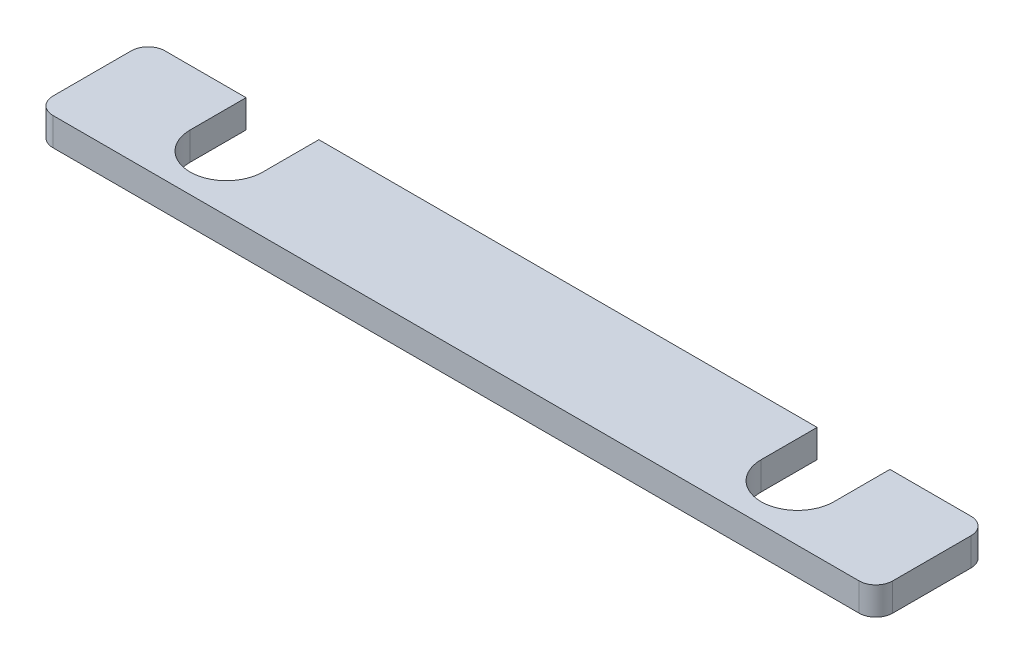
ISO-10303-21;
HEADER;
FILE_DESCRIPTION(('STEP AP214'),'2;1');
FILE_NAME('part.step','',(''),(''),'','','');
FILE_SCHEMA(('AUTOMOTIVE_DESIGN { 1 0 10303 214 1 1 1 1 }'));
ENDSEC;
DATA;
#1=APPLICATION_CONTEXT('core data for automotive mechanical design processes');
#2=APPLICATION_PROTOCOL_DEFINITION('international standard','automotive_design',2000,#1);
#3=PRODUCT_CONTEXT('',#1,'mechanical');
#4=PRODUCT('Part','Part','',(#3));
#5=PRODUCT_RELATED_PRODUCT_CATEGORY('part','',(#4));
#6=PRODUCT_DEFINITION_FORMATION('','',#4);
#7=PRODUCT_DEFINITION_CONTEXT('part definition',#1,'design');
#8=PRODUCT_DEFINITION('design','',#6,#7);
#9=PRODUCT_DEFINITION_SHAPE('','',#8);
#10=(LENGTH_UNIT() NAMED_UNIT(*) SI_UNIT(.MILLI.,.METRE.));
#11=(NAMED_UNIT(*) PLANE_ANGLE_UNIT() SI_UNIT($,.RADIAN.));
#12=(NAMED_UNIT(*) SI_UNIT($,.STERADIAN.) SOLID_ANGLE_UNIT());
#13=UNCERTAINTY_MEASURE_WITH_UNIT(LENGTH_MEASURE(1.E-05),#10,'distance_accuracy_value','');
#14=(GEOMETRIC_REPRESENTATION_CONTEXT(3) GLOBAL_UNCERTAINTY_ASSIGNED_CONTEXT((#13)) GLOBAL_UNIT_ASSIGNED_CONTEXT((#10,
#11,#12)) REPRESENTATION_CONTEXT('',''));
#15=CARTESIAN_POINT('',(0.,0.,0.));
#16=DIRECTION('',(0.,0.,1.));
#17=DIRECTION('',(1.,0.,0.));
#18=AXIS2_PLACEMENT_3D('',#15,#16,#17);
#19=CARTESIAN_POINT('',(-75.,-5.,-10.));
#20=DIRECTION('',(0.,0.,-1.));
#21=DIRECTION('',(-1.,0.,0.));
#22=AXIS2_PLACEMENT_3D('',#19,#20,#21);
#23=PLANE('',#22);
#24=DIRECTION('',(-1.,0.,0.));
#25=VECTOR('',#24,1.);
#26=CARTESIAN_POINT('',(-75.,0.,-10.));
#27=LINE('',#26,#25);
#28=CARTESIAN_POINT('',(72.,0.,-10.));
#29=VERTEX_POINT('',#28);
#30=CARTESIAN_POINT('',(57.5,0.,-10.));
#31=VERTEX_POINT('',#30);
#32=EDGE_CURVE('E228',#29,#31,#27,.T.);
#33=ORIENTED_EDGE('',*,*,#32,.F.);
#34=DIRECTION('',(0.,1.,0.));
#35=VECTOR('',#34,1.);
#36=CARTESIAN_POINT('',(72.,-5.,-10.));
#37=LINE('',#36,#35);
#38=CARTESIAN_POINT('',(72.,-5.,-10.));
#39=VERTEX_POINT('',#38);
#40=EDGE_CURVE('E265',#29,#39,#37,.F.);
#41=ORIENTED_EDGE('',*,*,#40,.T.);
#42=DIRECTION('',(-1.,0.,0.));
#43=VECTOR('',#42,1.);
#44=CARTESIAN_POINT('',(-75.,-5.,-10.));
#45=LINE('',#44,#43);
#46=CARTESIAN_POINT('',(57.5,-5.,-10.));
#47=VERTEX_POINT('',#46);
#48=EDGE_CURVE('E217',#39,#47,#45,.T.);
#49=ORIENTED_EDGE('',*,*,#48,.T.);
#50=DIRECTION('',(0.,1.,0.));
#51=VECTOR('',#50,1.);
#52=CARTESIAN_POINT('',(57.5,-5.,-10.));
#53=LINE('',#52,#51);
#54=EDGE_CURVE('E184',#47,#31,#53,.T.);
#55=ORIENTED_EDGE('',*,*,#54,.T.);
#56=EDGE_LOOP('',(#33,#41,#49,#55));
#57=FACE_BOUND('',#56,.T.);
#58=ADVANCED_FACE('F36',(#57),#23,.T.);
#59=CARTESIAN_POINT('',(44.5,0.,-10.));
#60=VERTEX_POINT('',#59);
#61=CARTESIAN_POINT('',(-44.5,0.,-10.));
#62=VERTEX_POINT('',#61);
#63=EDGE_CURVE('E231',#60,#62,#27,.T.);
#64=ORIENTED_EDGE('',*,*,#63,.F.);
#65=DIRECTION('',(0.,-1.,0.));
#66=VECTOR('',#65,1.);
#67=CARTESIAN_POINT('',(44.5,-5.,-10.));
#68=LINE('',#67,#66);
#69=CARTESIAN_POINT('',(44.5,-5.,-10.));
#70=VERTEX_POINT('',#69);
#71=EDGE_CURVE('E181',#60,#70,#68,.T.);
#72=ORIENTED_EDGE('',*,*,#71,.T.);
#73=CARTESIAN_POINT('',(-44.5,-5.,-10.));
#74=VERTEX_POINT('',#73);
#75=EDGE_CURVE('E174',#70,#74,#45,.T.);
#76=ORIENTED_EDGE('',*,*,#75,.T.);
#77=DIRECTION('',(0.,-1.,0.));
#78=VECTOR('',#77,1.);
#79=CARTESIAN_POINT('',(-44.5,-5.,-10.));
#80=LINE('',#79,#78);
#81=EDGE_CURVE('E208',#62,#74,#80,.T.);
#82=ORIENTED_EDGE('',*,*,#81,.F.);
#83=EDGE_LOOP('',(#64,#72,#76,#82));
#84=FACE_BOUND('',#83,.T.);
#85=ADVANCED_FACE('F288',(#84),#23,.T.);
#86=CARTESIAN_POINT('',(0.,-5.,0.));
#87=DIRECTION('',(0.,-1.,0.));
#88=DIRECTION('',(0.,0.,-1.));
#89=AXIS2_PLACEMENT_3D('',#86,#87,#88);
#90=PLANE('',#89);
#91=DIRECTION('',(0.,0.,-1.));
#92=VECTOR('',#91,1.);
#93=CARTESIAN_POINT('',(75.,-5.,10.));
#94=LINE('',#93,#92);
#95=CARTESIAN_POINT('',(75.,-5.,7.));
#96=VERTEX_POINT('',#95);
#97=CARTESIAN_POINT('',(75.,-5.,-7.));
#98=VERTEX_POINT('',#97);
#99=EDGE_CURVE('E212',#96,#98,#94,.T.);
#100=ORIENTED_EDGE('',*,*,#99,.F.);
#101=CARTESIAN_POINT('',(72.,-5.,7.));
#102=DIRECTION('',(0.,-1.,0.));
#103=DIRECTION('',(0.,0.,-1.));
#104=AXIS2_PLACEMENT_3D('',#101,#102,#103);
#105=CIRCLE('',#104,3.);
#106=CARTESIAN_POINT('',(72.,-5.,10.));
#107=VERTEX_POINT('',#106);
#108=EDGE_CURVE('E263',#96,#107,#105,.T.);
#109=ORIENTED_EDGE('',*,*,#108,.T.);
#110=DIRECTION('',(1.,0.,0.));
#111=VECTOR('',#110,1.);
#112=CARTESIAN_POINT('',(-75.,-5.,10.));
#113=LINE('',#112,#111);
#114=CARTESIAN_POINT('',(-72.,-5.,10.));
#115=VERTEX_POINT('',#114);
#116=EDGE_CURVE('E221',#115,#107,#113,.T.);
#117=ORIENTED_EDGE('',*,*,#116,.F.);
#118=CARTESIAN_POINT('',(-72.,-5.,7.));
#119=DIRECTION('',(0.,-1.,0.));
#120=DIRECTION('',(0.,0.,-1.));
#121=AXIS2_PLACEMENT_3D('',#118,#119,#120);
#122=CIRCLE('',#121,3.);
#123=CARTESIAN_POINT('',(-75.,-5.,7.));
#124=VERTEX_POINT('',#123);
#125=EDGE_CURVE('E57',#115,#124,#122,.T.);
#126=ORIENTED_EDGE('',*,*,#125,.T.);
#127=DIRECTION('',(0.,0.,1.));
#128=VECTOR('',#127,1.);
#129=CARTESIAN_POINT('',(-75.,-5.,10.));
#130=LINE('',#129,#128);
#131=CARTESIAN_POINT('',(-75.,-5.,-7.));
#132=VERTEX_POINT('',#131);
#133=EDGE_CURVE('E219',#132,#124,#130,.T.);
#134=ORIENTED_EDGE('',*,*,#133,.F.);
#135=CARTESIAN_POINT('',(-72.,-5.,-7.));
#136=DIRECTION('',(0.,-1.,0.));
#137=DIRECTION('',(0.,0.,-1.));
#138=AXIS2_PLACEMENT_3D('',#135,#136,#137);
#139=CIRCLE('',#138,3.);
#140=CARTESIAN_POINT('',(-72.,-5.,-10.));
#141=VERTEX_POINT('',#140);
#142=EDGE_CURVE('E51',#132,#141,#139,.T.);
#143=ORIENTED_EDGE('',*,*,#142,.T.);
#144=CARTESIAN_POINT('',(-57.5,-5.,-10.));
#145=VERTEX_POINT('',#144);
#146=EDGE_CURVE('E215',#145,#141,#45,.T.);
#147=ORIENTED_EDGE('',*,*,#146,.F.);
#148=DIRECTION('',(0.,0.,1.));
#149=VECTOR('',#148,1.);
#150=CARTESIAN_POINT('',(-57.5,-5.,-20.));
#151=LINE('',#150,#149);
#152=CARTESIAN_POINT('',(-57.5,-5.,0.));
#153=VERTEX_POINT('',#152);
#154=EDGE_CURVE('E188',#145,#153,#151,.T.);
#155=ORIENTED_EDGE('',*,*,#154,.T.);
#156=CARTESIAN_POINT('',(-51.,-5.,0.));
#157=DIRECTION('',(0.,1.,0.));
#158=DIRECTION('',(0.,0.,1.));
#159=AXIS2_PLACEMENT_3D('',#156,#157,#158);
#160=CIRCLE('',#159,6.5);
#161=CARTESIAN_POINT('',(-44.5,-5.,0.));
#162=VERTEX_POINT('',#161);
#163=EDGE_CURVE('E191',#153,#162,#160,.T.);
#164=ORIENTED_EDGE('',*,*,#163,.T.);
#165=DIRECTION('',(0.,0.,-1.));
#166=VECTOR('',#165,1.);
#167=CARTESIAN_POINT('',(-44.5,-5.,-20.));
#168=LINE('',#167,#166);
#169=EDGE_CURVE('E195',#162,#74,#168,.T.);
#170=ORIENTED_EDGE('',*,*,#169,.T.);
#171=ORIENTED_EDGE('',*,*,#75,.F.);
#172=DIRECTION('',(0.,0.,-1.));
#173=VECTOR('',#172,1.);
#174=CARTESIAN_POINT('',(44.5,-5.,-20.));
#175=LINE('',#174,#173);
#176=CARTESIAN_POINT('',(44.5,-5.,0.));
#177=VERTEX_POINT('',#176);
#178=EDGE_CURVE('E161',#177,#70,#175,.T.);
#179=ORIENTED_EDGE('',*,*,#178,.F.);
#180=CARTESIAN_POINT('',(51.,-5.,0.));
#181=DIRECTION('',(0.,-1.,0.));
#182=DIRECTION('',(0.,0.,1.));
#183=AXIS2_PLACEMENT_3D('',#180,#181,#182);
#184=CIRCLE('',#183,6.5);
#185=CARTESIAN_POINT('',(57.5,-5.,0.));
#186=VERTEX_POINT('',#185);
#187=EDGE_CURVE('E151',#186,#177,#184,.T.);
#188=ORIENTED_EDGE('',*,*,#187,.F.);
#189=DIRECTION('',(0.,0.,1.));
#190=VECTOR('',#189,1.);
#191=CARTESIAN_POINT('',(57.5,-5.,-20.));
#192=LINE('',#191,#190);
#193=EDGE_CURVE('E160',#47,#186,#192,.T.);
#194=ORIENTED_EDGE('',*,*,#193,.F.);
#195=ORIENTED_EDGE('',*,*,#48,.F.);
#196=CARTESIAN_POINT('',(72.,-5.,-7.));
#197=DIRECTION('',(0.,-1.,0.));
#198=DIRECTION('',(0.,0.,-1.));
#199=AXIS2_PLACEMENT_3D('',#196,#197,#198);
#200=CIRCLE('',#199,3.);
#201=EDGE_CURVE('E261',#39,#98,#200,.T.);
#202=ORIENTED_EDGE('',*,*,#201,.T.);
#203=EDGE_LOOP('',(#100,#109,#117,#126,#134,#143,#147,#155,#164,#170,#171,#179,#188,#194,#195,#202));
#204=FACE_BOUND('',#203,.T.);
#205=ADVANCED_FACE('F172',(#204),#90,.T.);
#206=CARTESIAN_POINT('',(0.,0.,0.));
#207=DIRECTION('',(0.,-1.,0.));
#208=DIRECTION('',(0.,0.,-1.));
#209=AXIS2_PLACEMENT_3D('',#206,#207,#208);
#210=PLANE('',#209);
#211=DIRECTION('',(1.,0.,0.));
#212=VECTOR('',#211,1.);
#213=CARTESIAN_POINT('',(-75.,0.,10.));
#214=LINE('',#213,#212);
#215=CARTESIAN_POINT('',(-72.,0.,10.));
#216=VERTEX_POINT('',#215);
#217=CARTESIAN_POINT('',(72.,0.,10.));
#218=VERTEX_POINT('',#217);
#219=EDGE_CURVE('E216',#216,#218,#214,.T.);
#220=ORIENTED_EDGE('',*,*,#219,.T.);
#221=CARTESIAN_POINT('',(72.,0.,7.));
#222=DIRECTION('',(0.,-1.,0.));
#223=DIRECTION('',(0.,0.,-1.));
#224=AXIS2_PLACEMENT_3D('',#221,#222,#223);
#225=CIRCLE('',#224,3.);
#226=CARTESIAN_POINT('',(75.,0.,7.));
#227=VERTEX_POINT('',#226);
#228=EDGE_CURVE('E252',#218,#227,#225,.F.);
#229=ORIENTED_EDGE('',*,*,#228,.T.);
#230=DIRECTION('',(0.,0.,-1.));
#231=VECTOR('',#230,1.);
#232=CARTESIAN_POINT('',(75.,0.,10.));
#233=LINE('',#232,#231);
#234=CARTESIAN_POINT('',(75.,0.,-7.));
#235=VERTEX_POINT('',#234);
#236=EDGE_CURVE('E211',#227,#235,#233,.T.);
#237=ORIENTED_EDGE('',*,*,#236,.T.);
#238=CARTESIAN_POINT('',(72.,0.,-7.));
#239=DIRECTION('',(0.,-1.,0.));
#240=DIRECTION('',(0.,0.,-1.));
#241=AXIS2_PLACEMENT_3D('',#238,#239,#240);
#242=CIRCLE('',#241,3.);
#243=EDGE_CURVE('E250',#235,#29,#242,.F.);
#244=ORIENTED_EDGE('',*,*,#243,.T.);
#245=ORIENTED_EDGE('',*,*,#32,.T.);
#246=DIRECTION('',(0.,0.,-1.));
#247=VECTOR('',#246,1.);
#248=CARTESIAN_POINT('',(57.5,0.,0.));
#249=LINE('',#248,#247);
#250=CARTESIAN_POINT('',(57.5,0.,0.));
#251=VERTEX_POINT('',#250);
#252=EDGE_CURVE('E238',#251,#31,#249,.T.);
#253=ORIENTED_EDGE('',*,*,#252,.F.);
#254=CARTESIAN_POINT('',(51.,0.,0.));
#255=DIRECTION('',(0.,-1.,0.));
#256=DIRECTION('',(0.,0.,1.));
#257=AXIS2_PLACEMENT_3D('',#254,#255,#256);
#258=CIRCLE('',#257,6.5);
#259=CARTESIAN_POINT('',(44.5,0.,0.));
#260=VERTEX_POINT('',#259);
#261=EDGE_CURVE('E175',#251,#260,#258,.T.);
#262=ORIENTED_EDGE('',*,*,#261,.T.);
#263=DIRECTION('',(0.,0.,-1.));
#264=VECTOR('',#263,1.);
#265=CARTESIAN_POINT('',(44.5,0.,-20.));
#266=LINE('',#265,#264);
#267=EDGE_CURVE('E167',#260,#60,#266,.T.);
#268=ORIENTED_EDGE('',*,*,#267,.T.);
#269=ORIENTED_EDGE('',*,*,#63,.T.);
#270=DIRECTION('',(0.,0.,-1.));
#271=VECTOR('',#270,1.);
#272=CARTESIAN_POINT('',(-44.5,0.,-20.));
#273=LINE('',#272,#271);
#274=CARTESIAN_POINT('',(-44.5,0.,0.));
#275=VERTEX_POINT('',#274);
#276=EDGE_CURVE('E192',#275,#62,#273,.T.);
#277=ORIENTED_EDGE('',*,*,#276,.F.);
#278=CARTESIAN_POINT('',(-51.,0.,0.));
#279=DIRECTION('',(0.,1.,0.));
#280=DIRECTION('',(0.,0.,1.));
#281=AXIS2_PLACEMENT_3D('',#278,#279,#280);
#282=CIRCLE('',#281,6.5);
#283=CARTESIAN_POINT('',(-57.5,0.,0.));
#284=VERTEX_POINT('',#283);
#285=EDGE_CURVE('E187',#284,#275,#282,.T.);
#286=ORIENTED_EDGE('',*,*,#285,.F.);
#287=DIRECTION('',(0.,0.,-1.));
#288=VECTOR('',#287,1.);
#289=CARTESIAN_POINT('',(-57.5,0.,0.));
#290=LINE('',#289,#288);
#291=CARTESIAN_POINT('',(-57.5,0.,-10.));
#292=VERTEX_POINT('',#291);
#293=EDGE_CURVE('E224',#284,#292,#290,.T.);
#294=ORIENTED_EDGE('',*,*,#293,.T.);
#295=CARTESIAN_POINT('',(-72.,0.,-10.));
#296=VERTEX_POINT('',#295);
#297=EDGE_CURVE('E227',#292,#296,#27,.T.);
#298=ORIENTED_EDGE('',*,*,#297,.T.);
#299=CARTESIAN_POINT('',(-72.,0.,-7.));
#300=DIRECTION('',(0.,-1.,0.));
#301=DIRECTION('',(0.,0.,-1.));
#302=AXIS2_PLACEMENT_3D('',#299,#300,#301);
#303=CIRCLE('',#302,3.);
#304=CARTESIAN_POINT('',(-75.,0.,-7.));
#305=VERTEX_POINT('',#304);
#306=EDGE_CURVE('E246',#296,#305,#303,.F.);
#307=ORIENTED_EDGE('',*,*,#306,.T.);
#308=DIRECTION('',(0.,0.,1.));
#309=VECTOR('',#308,1.);
#310=CARTESIAN_POINT('',(-75.,0.,10.));
#311=LINE('',#310,#309);
#312=CARTESIAN_POINT('',(-75.,0.,7.));
#313=VERTEX_POINT('',#312);
#314=EDGE_CURVE('E230',#305,#313,#311,.T.);
#315=ORIENTED_EDGE('',*,*,#314,.T.);
#316=CARTESIAN_POINT('',(-72.,0.,7.));
#317=DIRECTION('',(0.,-1.,0.));
#318=DIRECTION('',(0.,0.,-1.));
#319=AXIS2_PLACEMENT_3D('',#316,#317,#318);
#320=CIRCLE('',#319,3.);
#321=EDGE_CURVE('E248',#313,#216,#320,.F.);
#322=ORIENTED_EDGE('',*,*,#321,.T.);
#323=EDGE_LOOP('',(#220,#229,#237,#244,#245,#253,#262,#268,#269,#277,#286,#294,#298,#307,#315,#322));
#324=FACE_BOUND('',#323,.T.);
#325=ADVANCED_FACE('F276',(#324),#210,.F.);
#326=CARTESIAN_POINT('',(75.,-5.,10.));
#327=DIRECTION('',(1.,0.,0.));
#328=DIRECTION('',(0.,0.,-1.));
#329=AXIS2_PLACEMENT_3D('',#326,#327,#328);
#330=PLANE('',#329);
#331=ORIENTED_EDGE('',*,*,#236,.F.);
#332=DIRECTION('',(0.,1.,0.));
#333=VECTOR('',#332,1.);
#334=CARTESIAN_POINT('',(75.,-5.,7.));
#335=LINE('',#334,#333);
#336=EDGE_CURVE('E257',#227,#96,#335,.F.);
#337=ORIENTED_EDGE('',*,*,#336,.T.);
#338=ORIENTED_EDGE('',*,*,#99,.T.);
#339=DIRECTION('',(0.,1.,0.));
#340=VECTOR('',#339,1.);
#341=CARTESIAN_POINT('',(75.,-5.,-7.));
#342=LINE('',#341,#340);
#343=EDGE_CURVE('E254',#98,#235,#342,.T.);
#344=ORIENTED_EDGE('',*,*,#343,.T.);
#345=EDGE_LOOP('',(#331,#337,#338,#344));
#346=FACE_BOUND('',#345,.T.);
#347=ADVANCED_FACE('F311',(#346),#330,.T.);
#348=CARTESIAN_POINT('',(-75.,-5.,10.));
#349=DIRECTION('',(0.,0.,1.));
#350=DIRECTION('',(1.,0.,0.));
#351=AXIS2_PLACEMENT_3D('',#348,#349,#350);
#352=PLANE('',#351);
#353=ORIENTED_EDGE('',*,*,#116,.T.);
#354=DIRECTION('',(0.,1.,0.));
#355=VECTOR('',#354,1.);
#356=CARTESIAN_POINT('',(72.,-5.,10.));
#357=LINE('',#356,#355);
#358=EDGE_CURVE('E243',#107,#218,#357,.T.);
#359=ORIENTED_EDGE('',*,*,#358,.T.);
#360=ORIENTED_EDGE('',*,*,#219,.F.);
#361=DIRECTION('',(0.,1.,0.));
#362=VECTOR('',#361,1.);
#363=CARTESIAN_POINT('',(-72.,-5.,10.));
#364=LINE('',#363,#362);
#365=EDGE_CURVE('E241',#216,#115,#364,.F.);
#366=ORIENTED_EDGE('',*,*,#365,.T.);
#367=EDGE_LOOP('',(#353,#359,#360,#366));
#368=FACE_BOUND('',#367,.T.);
#369=ADVANCED_FACE('F318',(#368),#352,.T.);
#370=CARTESIAN_POINT('',(-75.,-5.,10.));
#371=DIRECTION('',(-1.,0.,0.));
#372=DIRECTION('',(0.,0.,1.));
#373=AXIS2_PLACEMENT_3D('',#370,#371,#372);
#374=PLANE('',#373);
#375=ORIENTED_EDGE('',*,*,#133,.T.);
#376=DIRECTION('',(0.,1.,0.));
#377=VECTOR('',#376,1.);
#378=CARTESIAN_POINT('',(-75.,-5.,7.));
#379=LINE('',#378,#377);
#380=EDGE_CURVE('E44',#124,#313,#379,.T.);
#381=ORIENTED_EDGE('',*,*,#380,.T.);
#382=ORIENTED_EDGE('',*,*,#314,.F.);
#383=DIRECTION('',(0.,1.,0.));
#384=VECTOR('',#383,1.);
#385=CARTESIAN_POINT('',(-75.,-5.,-7.));
#386=LINE('',#385,#384);
#387=EDGE_CURVE('E267',#305,#132,#386,.F.);
#388=ORIENTED_EDGE('',*,*,#387,.T.);
#389=EDGE_LOOP('',(#375,#381,#382,#388));
#390=FACE_BOUND('',#389,.T.);
#391=ADVANCED_FACE('F272',(#390),#374,.T.);
#392=ORIENTED_EDGE('',*,*,#146,.T.);
#393=DIRECTION('',(0.,1.,0.));
#394=VECTOR('',#393,1.);
#395=CARTESIAN_POINT('',(-72.,-5.,-10.));
#396=LINE('',#395,#394);
#397=EDGE_CURVE('E11',#141,#296,#396,.T.);
#398=ORIENTED_EDGE('',*,*,#397,.T.);
#399=ORIENTED_EDGE('',*,*,#297,.F.);
#400=DIRECTION('',(0.,1.,0.));
#401=VECTOR('',#400,1.);
#402=CARTESIAN_POINT('',(-57.5,-5.,-10.));
#403=LINE('',#402,#401);
#404=EDGE_CURVE('E204',#145,#292,#403,.T.);
#405=ORIENTED_EDGE('',*,*,#404,.F.);
#406=EDGE_LOOP('',(#392,#398,#399,#405));
#407=FACE_BOUND('',#406,.T.);
#408=ADVANCED_FACE('F283',(#407),#23,.T.);
#409=CARTESIAN_POINT('',(-44.5,-5.,-20.));
#410=DIRECTION('',(1.,0.,0.));
#411=DIRECTION('',(0.,0.,-1.));
#412=AXIS2_PLACEMENT_3D('',#409,#410,#411);
#413=PLANE('',#412);
#414=ORIENTED_EDGE('',*,*,#81,.T.);
#415=ORIENTED_EDGE('',*,*,#169,.F.);
#416=DIRECTION('',(0.,1.,0.));
#417=VECTOR('',#416,1.);
#418=CARTESIAN_POINT('',(-44.5,-5.,0.));
#419=LINE('',#418,#417);
#420=EDGE_CURVE('E202',#162,#275,#419,.T.);
#421=ORIENTED_EDGE('',*,*,#420,.T.);
#422=ORIENTED_EDGE('',*,*,#276,.T.);
#423=EDGE_LOOP('',(#414,#415,#421,#422));
#424=FACE_BOUND('',#423,.T.);
#425=ADVANCED_FACE('F291',(#424),#413,.F.);
#426=CARTESIAN_POINT('',(-51.,-5.,0.));
#427=DIRECTION('',(0.,1.,0.));
#428=DIRECTION('',(0.,0.,1.));
#429=AXIS2_PLACEMENT_3D('',#426,#427,#428);
#430=CYLINDRICAL_SURFACE('',#429,6.5);
#431=ORIENTED_EDGE('',*,*,#285,.T.);
#432=ORIENTED_EDGE('',*,*,#420,.F.);
#433=ORIENTED_EDGE('',*,*,#163,.F.);
#434=DIRECTION('',(0.,1.,0.));
#435=VECTOR('',#434,1.);
#436=CARTESIAN_POINT('',(-57.5,-5.,0.));
#437=LINE('',#436,#435);
#438=EDGE_CURVE('E197',#153,#284,#437,.T.);
#439=ORIENTED_EDGE('',*,*,#438,.T.);
#440=EDGE_LOOP('',(#431,#432,#433,#439));
#441=FACE_BOUND('',#440,.T.);
#442=ADVANCED_FACE('F295',(#441),#430,.F.);
#443=CARTESIAN_POINT('',(-57.5,-5.,-20.));
#444=DIRECTION('',(-1.,0.,0.));
#445=DIRECTION('',(0.,0.,1.));
#446=AXIS2_PLACEMENT_3D('',#443,#444,#445);
#447=PLANE('',#446);
#448=ORIENTED_EDGE('',*,*,#404,.T.);
#449=ORIENTED_EDGE('',*,*,#293,.F.);
#450=ORIENTED_EDGE('',*,*,#438,.F.);
#451=ORIENTED_EDGE('',*,*,#154,.F.);
#452=EDGE_LOOP('',(#448,#449,#450,#451));
#453=FACE_BOUND('',#452,.T.);
#454=ADVANCED_FACE('F349',(#453),#447,.F.);
#455=CARTESIAN_POINT('',(57.5,-5.,-20.));
#456=DIRECTION('',(-1.,0.,0.));
#457=DIRECTION('',(0.,0.,1.));
#458=AXIS2_PLACEMENT_3D('',#455,#456,#457);
#459=PLANE('',#458);
#460=ORIENTED_EDGE('',*,*,#193,.T.);
#461=DIRECTION('',(0.,1.,0.));
#462=VECTOR('',#461,1.);
#463=CARTESIAN_POINT('',(57.5,-5.,0.));
#464=LINE('',#463,#462);
#465=EDGE_CURVE('E157',#186,#251,#464,.T.);
#466=ORIENTED_EDGE('',*,*,#465,.T.);
#467=ORIENTED_EDGE('',*,*,#252,.T.);
#468=ORIENTED_EDGE('',*,*,#54,.F.);
#469=EDGE_LOOP('',(#460,#466,#467,#468));
#470=FACE_BOUND('',#469,.T.);
#471=ADVANCED_FACE('F301',(#470),#459,.T.);
#472=CARTESIAN_POINT('',(51.,-5.,0.));
#473=DIRECTION('',(0.,1.,0.));
#474=DIRECTION('',(0.,0.,1.));
#475=AXIS2_PLACEMENT_3D('',#472,#473,#474);
#476=CYLINDRICAL_SURFACE('',#475,6.5);
#477=ORIENTED_EDGE('',*,*,#261,.F.);
#478=ORIENTED_EDGE('',*,*,#465,.F.);
#479=ORIENTED_EDGE('',*,*,#187,.T.);
#480=DIRECTION('',(0.,1.,0.));
#481=VECTOR('',#480,1.);
#482=CARTESIAN_POINT('',(44.5,-5.,0.));
#483=LINE('',#482,#481);
#484=EDGE_CURVE('E155',#177,#260,#483,.T.);
#485=ORIENTED_EDGE('',*,*,#484,.T.);
#486=EDGE_LOOP('',(#477,#478,#479,#485));
#487=FACE_BOUND('',#486,.T.);
#488=ADVANCED_FACE('F154',(#487),#476,.F.);
#489=CARTESIAN_POINT('',(44.5,-5.,-20.));
#490=DIRECTION('',(1.,0.,0.));
#491=DIRECTION('',(0.,0.,-1.));
#492=AXIS2_PLACEMENT_3D('',#489,#490,#491);
#493=PLANE('',#492);
#494=ORIENTED_EDGE('',*,*,#267,.F.);
#495=ORIENTED_EDGE('',*,*,#484,.F.);
#496=ORIENTED_EDGE('',*,*,#178,.T.);
#497=ORIENTED_EDGE('',*,*,#71,.F.);
#498=EDGE_LOOP('',(#494,#495,#496,#497));
#499=FACE_BOUND('',#498,.T.);
#500=ADVANCED_FACE('F164',(#499),#493,.T.);
#501=CARTESIAN_POINT('',(72.,-5.,7.));
#502=DIRECTION('',(0.,1.,0.));
#503=DIRECTION('',(0.,0.,1.));
#504=AXIS2_PLACEMENT_3D('',#501,#502,#503);
#505=CYLINDRICAL_SURFACE('',#504,3.);
#506=ORIENTED_EDGE('',*,*,#108,.F.);
#507=ORIENTED_EDGE('',*,*,#336,.F.);
#508=ORIENTED_EDGE('',*,*,#228,.F.);
#509=ORIENTED_EDGE('',*,*,#358,.F.);
#510=EDGE_LOOP('',(#506,#507,#508,#509));
#511=FACE_BOUND('',#510,.T.);
#512=ADVANCED_FACE('F316',(#511),#505,.T.);
#513=CARTESIAN_POINT('',(72.,-5.,-7.));
#514=DIRECTION('',(0.,1.,0.));
#515=DIRECTION('',(0.,0.,1.));
#516=AXIS2_PLACEMENT_3D('',#513,#514,#515);
#517=CYLINDRICAL_SURFACE('',#516,3.);
#518=ORIENTED_EDGE('',*,*,#201,.F.);
#519=ORIENTED_EDGE('',*,*,#40,.F.);
#520=ORIENTED_EDGE('',*,*,#243,.F.);
#521=ORIENTED_EDGE('',*,*,#343,.F.);
#522=EDGE_LOOP('',(#518,#519,#520,#521));
#523=FACE_BOUND('',#522,.T.);
#524=ADVANCED_FACE('F308',(#523),#517,.T.);
#525=CARTESIAN_POINT('',(-72.,-5.,7.));
#526=DIRECTION('',(0.,1.,0.));
#527=DIRECTION('',(0.,0.,1.));
#528=AXIS2_PLACEMENT_3D('',#525,#526,#527);
#529=CYLINDRICAL_SURFACE('',#528,3.);
#530=ORIENTED_EDGE('',*,*,#125,.F.);
#531=ORIENTED_EDGE('',*,*,#365,.F.);
#532=ORIENTED_EDGE('',*,*,#321,.F.);
#533=ORIENTED_EDGE('',*,*,#380,.F.);
#534=EDGE_LOOP('',(#530,#531,#532,#533));
#535=FACE_BOUND('',#534,.T.);
#536=ADVANCED_FACE('F320',(#535),#529,.T.);
#537=CARTESIAN_POINT('',(-72.,-5.,-7.));
#538=DIRECTION('',(0.,1.,0.));
#539=DIRECTION('',(0.,0.,1.));
#540=AXIS2_PLACEMENT_3D('',#537,#538,#539);
#541=CYLINDRICAL_SURFACE('',#540,3.);
#542=ORIENTED_EDGE('',*,*,#142,.F.);
#543=ORIENTED_EDGE('',*,*,#387,.F.);
#544=ORIENTED_EDGE('',*,*,#306,.F.);
#545=ORIENTED_EDGE('',*,*,#397,.F.);
#546=EDGE_LOOP('',(#542,#543,#544,#545));
#547=FACE_BOUND('',#546,.T.);
#548=ADVANCED_FACE('F38',(#547),#541,.T.);
#549=CLOSED_SHELL('',(#58,#85,#205,#325,#347,#369,#391,#408,#425,#442,#454,#471,#488,#500,#512,
#524,#536,#548));
#550=MANIFOLD_SOLID_BREP('B2',#549);
#551=ADVANCED_BREP_SHAPE_REPRESENTATION('',(#18,#550),#14);
#552=SHAPE_DEFINITION_REPRESENTATION(#9,#551);
ENDSEC;
END-ISO-10303-21;
